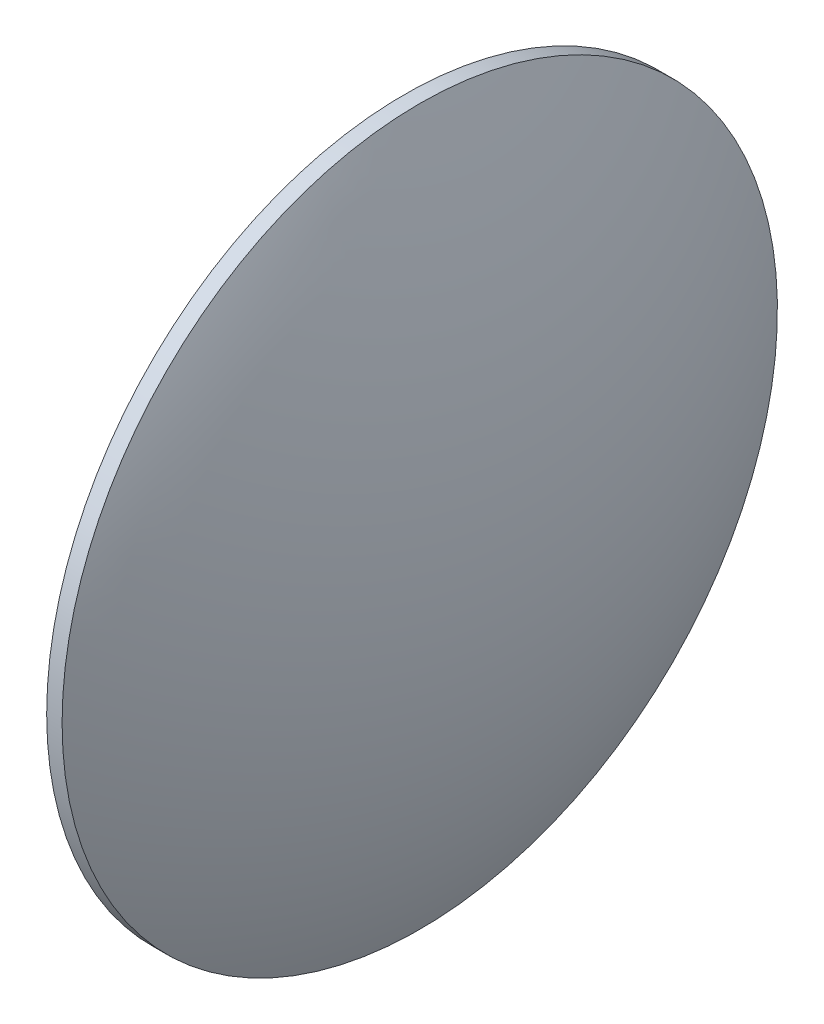
ISO-10303-21;
HEADER;
FILE_DESCRIPTION(('STEP AP214'),'2;1');
FILE_NAME('part.step','',(''),(''),'','','');
FILE_SCHEMA(('AUTOMOTIVE_DESIGN { 1 0 10303 214 1 1 1 1 }'));
ENDSEC;
DATA;
#1=APPLICATION_CONTEXT('core data for automotive mechanical design processes');
#2=APPLICATION_PROTOCOL_DEFINITION('international standard','automotive_design',2000,#1);
#3=PRODUCT_CONTEXT('',#1,'mechanical');
#4=PRODUCT('Part','Part','',(#3));
#5=PRODUCT_RELATED_PRODUCT_CATEGORY('part','',(#4));
#6=PRODUCT_DEFINITION_FORMATION('','',#4);
#7=PRODUCT_DEFINITION_CONTEXT('part definition',#1,'design');
#8=PRODUCT_DEFINITION('design','',#6,#7);
#9=PRODUCT_DEFINITION_SHAPE('','',#8);
#10=(LENGTH_UNIT() NAMED_UNIT(*) SI_UNIT(.MILLI.,.METRE.));
#11=(NAMED_UNIT(*) PLANE_ANGLE_UNIT() SI_UNIT($,.RADIAN.));
#12=(NAMED_UNIT(*) SI_UNIT($,.STERADIAN.) SOLID_ANGLE_UNIT());
#13=UNCERTAINTY_MEASURE_WITH_UNIT(LENGTH_MEASURE(1.E-05),#10,'distance_accuracy_value','');
#14=(GEOMETRIC_REPRESENTATION_CONTEXT(3) GLOBAL_UNCERTAINTY_ASSIGNED_CONTEXT((#13)) GLOBAL_UNIT_ASSIGNED_CONTEXT((#10,
#11,#12)) REPRESENTATION_CONTEXT('',''));
#15=CARTESIAN_POINT('',(0.,0.,0.));
#16=DIRECTION('',(0.,0.,1.));
#17=DIRECTION('',(1.,0.,0.));
#18=AXIS2_PLACEMENT_3D('',#15,#16,#17);
#19=CARTESIAN_POINT('',(344.917264750459,50.6631957722851,0.));
#20=DIRECTION('',(-1.,0.,0.));
#21=DIRECTION('',(0.,1.,0.));
#22=AXIS2_PLACEMENT_3D('',#19,#20,#21);
#23=SPHERICAL_SURFACE('',#22,51.9071052631579);
#24=CARTESIAN_POINT('',(391.694370013617,50.6631957722851,0.));
#25=DIRECTION('',(-1.,0.,0.));
#26=DIRECTION('',(0.,0.,1.));
#27=AXIS2_PLACEMENT_3D('',#24,#25,#26);
#28=CIRCLE('',#27,22.5);
#29=CARTESIAN_POINT('',(391.694370013617,50.6631957722851,22.5));
#30=VERTEX_POINT('',#29);
#31=EDGE_CURVE('E10',#30,#30,#28,.T.);
#32=ORIENTED_EDGE('',*,*,#31,.F.);
#33=EDGE_LOOP('',(#32));
#34=FACE_BOUND('',#33,.T.);
#35=ADVANCED_FACE('F35',(#34),#23,.T.);
#36=CARTESIAN_POINT('',(381.289590128464,50.6631957722851,0.));
#37=DIRECTION('',(-1.,0.,0.));
#38=DIRECTION('',(0.,0.,1.));
#39=AXIS2_PLACEMENT_3D('',#36,#37,#38);
#40=CYLINDRICAL_SURFACE('',#39,22.5);
#41=CARTESIAN_POINT('',(390.724370013617,50.6631957722851,0.));
#42=DIRECTION('',(-1.,0.,0.));
#43=DIRECTION('',(0.,0.,1.));
#44=AXIS2_PLACEMENT_3D('',#41,#42,#43);
#45=CIRCLE('',#44,22.5);
#46=CARTESIAN_POINT('',(390.724370013617,50.6631957722851,22.5));
#47=VERTEX_POINT('',#46);
#48=EDGE_CURVE('E41',#47,#47,#45,.T.);
#49=ORIENTED_EDGE('',*,*,#48,.F.);
#50=EDGE_LOOP('',(#49));
#51=FACE_BOUND('',#50,.T.);
#52=ORIENTED_EDGE('',*,*,#31,.T.);
#53=EDGE_LOOP('',(#52));
#54=FACE_BOUND('',#53,.T.);
#55=ADVANCED_FACE('F49',(#51,#54),#40,.T.);
#56=CARTESIAN_POINT('',(390.724370013617,50.6631957722851,0.));
#57=DIRECTION('',(1.,0.,0.));
#58=DIRECTION('',(0.,0.,-1.));
#59=AXIS2_PLACEMENT_3D('',#56,#57,#58);
#60=PLANE('',#59);
#61=ORIENTED_EDGE('',*,*,#48,.T.);
#62=EDGE_LOOP('',(#61));
#63=FACE_BOUND('',#62,.T.);
#64=ADVANCED_FACE('F47',(#63),#60,.F.);
#65=CLOSED_SHELL('',(#35,#55,#64));
#66=MANIFOLD_SOLID_BREP('B2',#65);
#67=ADVANCED_BREP_SHAPE_REPRESENTATION('',(#18,#66),#14);
#68=SHAPE_DEFINITION_REPRESENTATION(#9,#67);
ENDSEC;
END-ISO-10303-21;
